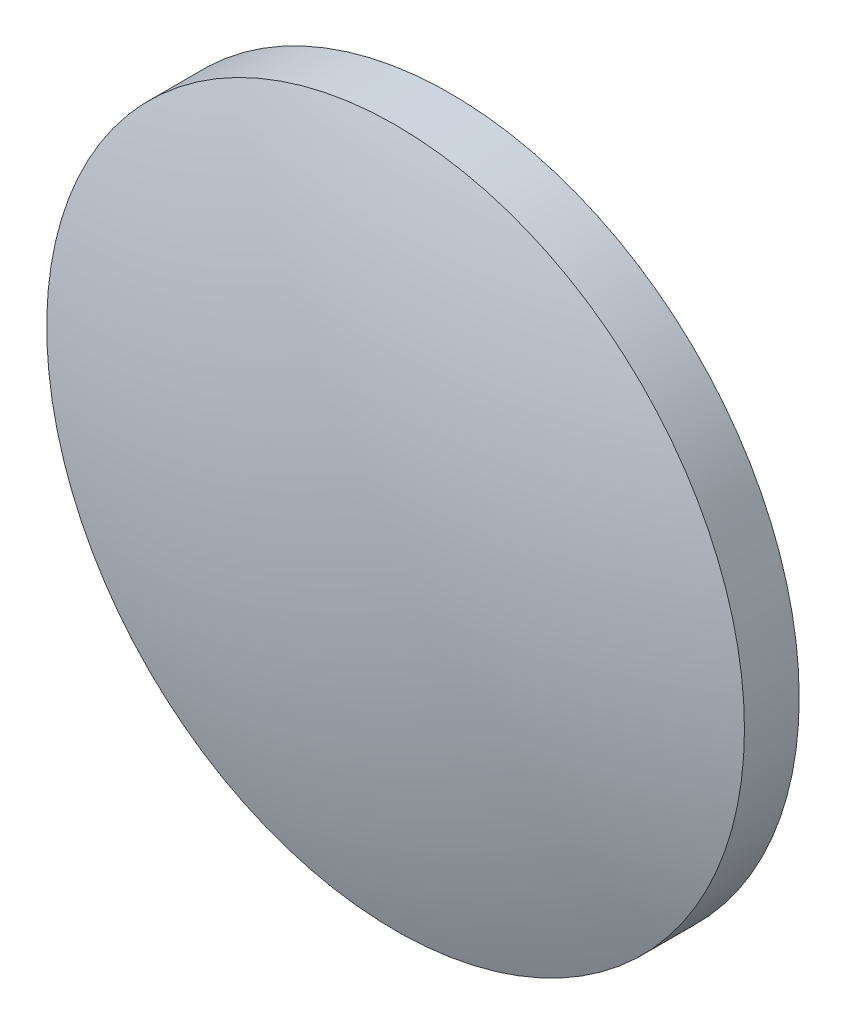
ISO-10303-21;
HEADER;
FILE_DESCRIPTION(('STEP AP214'),'2;1');
FILE_NAME('part.step','',(''),(''),'','','');
FILE_SCHEMA(('AUTOMOTIVE_DESIGN { 1 0 10303 214 1 1 1 1 }'));
ENDSEC;
DATA;
#1=APPLICATION_CONTEXT('core data for automotive mechanical design processes');
#2=APPLICATION_PROTOCOL_DEFINITION('international standard','automotive_design',2000,#1);
#3=PRODUCT_CONTEXT('',#1,'mechanical');
#4=PRODUCT('Part','Part','',(#3));
#5=PRODUCT_RELATED_PRODUCT_CATEGORY('part','',(#4));
#6=PRODUCT_DEFINITION_FORMATION('','',#4);
#7=PRODUCT_DEFINITION_CONTEXT('part definition',#1,'design');
#8=PRODUCT_DEFINITION('design','',#6,#7);
#9=PRODUCT_DEFINITION_SHAPE('','',#8);
#10=(LENGTH_UNIT() NAMED_UNIT(*) SI_UNIT(.MILLI.,.METRE.));
#11=(NAMED_UNIT(*) PLANE_ANGLE_UNIT() SI_UNIT($,.RADIAN.));
#12=(NAMED_UNIT(*) SI_UNIT($,.STERADIAN.) SOLID_ANGLE_UNIT());
#13=UNCERTAINTY_MEASURE_WITH_UNIT(LENGTH_MEASURE(1.E-05),#10,'distance_accuracy_value','');
#14=(GEOMETRIC_REPRESENTATION_CONTEXT(3) GLOBAL_UNCERTAINTY_ASSIGNED_CONTEXT((#13)) GLOBAL_UNIT_ASSIGNED_CONTEXT((#10,
#11,#12)) REPRESENTATION_CONTEXT('',''));
#15=CARTESIAN_POINT('',(0.,0.,0.));
#16=DIRECTION('',(0.,0.,1.));
#17=DIRECTION('',(1.,0.,0.));
#18=AXIS2_PLACEMENT_3D('',#15,#16,#17);
#19=CARTESIAN_POINT('',(0.,0.,-36.56));
#20=DIRECTION('',(0.,0.,1.));
#21=DIRECTION('',(0.,1.,0.));
#22=AXIS2_PLACEMENT_3D('',#19,#20,#21);
#23=SPHERICAL_SURFACE('',#22,38.63);
#24=CARTESIAN_POINT('',(0.,0.,-0.0773068428329953));
#25=DIRECTION('',(0.,0.,1.));
#26=DIRECTION('',(1.,0.,0.));
#27=AXIS2_PLACEMENT_3D('',#24,#25,#26);
#28=CIRCLE('',#27,12.7);
#29=CARTESIAN_POINT('',(12.7,0.,-0.0773068428329953));
#30=VERTEX_POINT('',#29);
#31=EDGE_CURVE('E8',#30,#30,#28,.T.);
#32=ORIENTED_EDGE('',*,*,#31,.T.);
#33=EDGE_LOOP('',(#32));
#34=FACE_BOUND('',#33,.T.);
#35=ADVANCED_FACE('F12',(#34),#23,.T.);
#36=CARTESIAN_POINT('',(0.,0.,4.30813204540037));
#37=DIRECTION('',(0.,0.,1.));
#38=DIRECTION('',(1.,0.,0.));
#39=AXIS2_PLACEMENT_3D('',#36,#37,#38);
#40=CYLINDRICAL_SURFACE('',#39,12.7);
#41=ORIENTED_EDGE('',*,*,#31,.F.);
#42=EDGE_LOOP('',(#41));
#43=FACE_BOUND('',#42,.T.);
#44=CARTESIAN_POINT('',(0.,0.,-2.07));
#45=DIRECTION('',(0.,0.,1.));
#46=DIRECTION('',(1.,0.,0.));
#47=AXIS2_PLACEMENT_3D('',#44,#45,#46);
#48=CIRCLE('',#47,12.7);
#49=CARTESIAN_POINT('',(12.7,0.,-2.07));
#50=VERTEX_POINT('',#49);
#51=EDGE_CURVE('E18',#50,#50,#48,.T.);
#52=ORIENTED_EDGE('',*,*,#51,.T.);
#53=EDGE_LOOP('',(#52));
#54=FACE_BOUND('',#53,.T.);
#55=ADVANCED_FACE('F24',(#43,#54),#40,.T.);
#56=CARTESIAN_POINT('',(0.,0.,-2.07));
#57=DIRECTION('',(0.,0.,1.));
#58=DIRECTION('',(1.,0.,0.));
#59=AXIS2_PLACEMENT_3D('',#56,#57,#58);
#60=PLANE('',#59);
#61=ORIENTED_EDGE('',*,*,#51,.F.);
#62=EDGE_LOOP('',(#61));
#63=FACE_BOUND('',#62,.T.);
#64=ADVANCED_FACE('F26',(#63),#60,.F.);
#65=CLOSED_SHELL('',(#35,#55,#64));
#66=MANIFOLD_SOLID_BREP('B1',#65);
#67=ADVANCED_BREP_SHAPE_REPRESENTATION('',(#18,#66),#14);
#68=SHAPE_DEFINITION_REPRESENTATION(#9,#67);
ENDSEC;
END-ISO-10303-21;
